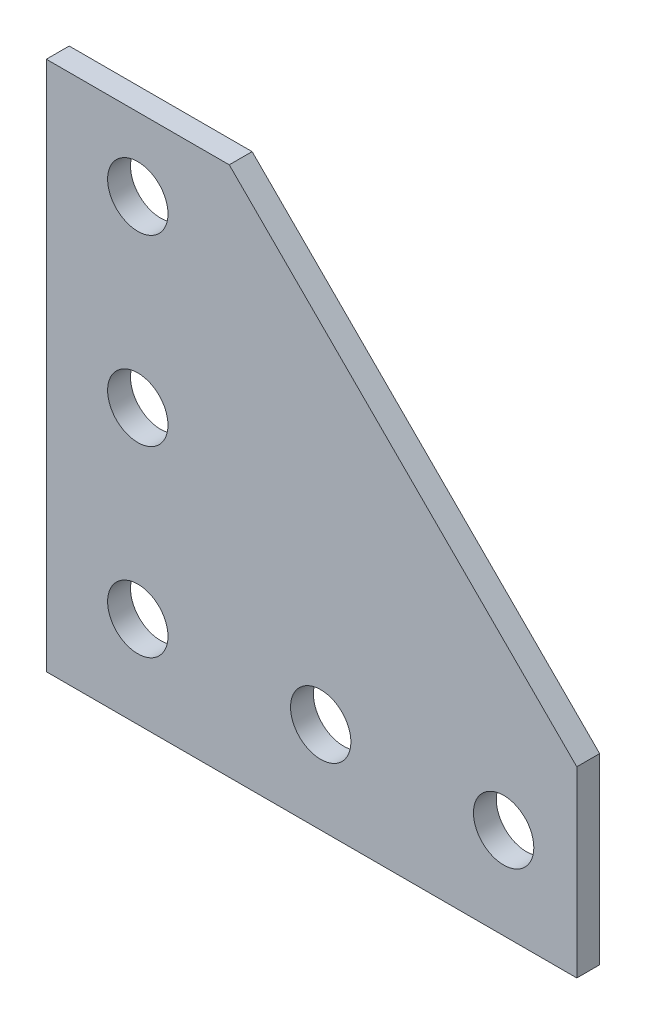
ISO-10303-21;
HEADER;
FILE_DESCRIPTION(('STEP AP214'),'2;1');
FILE_NAME('part.step','',(''),(''),'','','');
FILE_SCHEMA(('AUTOMOTIVE_DESIGN { 1 0 10303 214 1 1 1 1 }'));
ENDSEC;
DATA;
#1=APPLICATION_CONTEXT('core data for automotive mechanical design processes');
#2=APPLICATION_PROTOCOL_DEFINITION('international standard','automotive_design',2000,#1);
#3=PRODUCT_CONTEXT('',#1,'mechanical');
#4=PRODUCT('Part','Part','',(#3));
#5=PRODUCT_RELATED_PRODUCT_CATEGORY('part','',(#4));
#6=PRODUCT_DEFINITION_FORMATION('','',#4);
#7=PRODUCT_DEFINITION_CONTEXT('part definition',#1,'design');
#8=PRODUCT_DEFINITION('design','',#6,#7);
#9=PRODUCT_DEFINITION_SHAPE('','',#8);
#10=(LENGTH_UNIT() NAMED_UNIT(*) SI_UNIT(.MILLI.,.METRE.));
#11=(NAMED_UNIT(*) PLANE_ANGLE_UNIT() SI_UNIT($,.RADIAN.));
#12=(NAMED_UNIT(*) SI_UNIT($,.STERADIAN.) SOLID_ANGLE_UNIT());
#13=UNCERTAINTY_MEASURE_WITH_UNIT(LENGTH_MEASURE(1.E-05),#10,'distance_accuracy_value','');
#14=(GEOMETRIC_REPRESENTATION_CONTEXT(3) GLOBAL_UNCERTAINTY_ASSIGNED_CONTEXT((#13)) GLOBAL_UNIT_ASSIGNED_CONTEXT((#10,
#11,#12)) REPRESENTATION_CONTEXT('',''));
#15=CARTESIAN_POINT('',(0.,0.,0.));
#16=DIRECTION('',(0.,0.,1.));
#17=DIRECTION('',(1.,0.,0.));
#18=AXIS2_PLACEMENT_3D('',#15,#16,#17);
#19=CARTESIAN_POINT('',(-19.,21.,0.));
#20=DIRECTION('',(0.,0.,1.));
#21=DIRECTION('',(1.,0.,0.));
#22=AXIS2_PLACEMENT_3D('',#19,#20,#21);
#23=CYLINDRICAL_SURFACE('',#22,3.3);
#24=CARTESIAN_POINT('',(-19.,21.,0.));
#25=DIRECTION('',(0.,0.,1.));
#26=DIRECTION('',(1.,0.,0.));
#27=AXIS2_PLACEMENT_3D('',#24,#25,#26);
#28=CIRCLE('',#27,3.3);
#29=CARTESIAN_POINT('',(-15.7,21.,0.));
#30=VERTEX_POINT('',#29);
#31=EDGE_CURVE('E40',#30,#30,#28,.T.);
#32=ORIENTED_EDGE('',*,*,#31,.F.);
#33=EDGE_LOOP('',(#32));
#34=FACE_BOUND('',#33,.T.);
#35=CARTESIAN_POINT('',(-19.,21.,2.5));
#36=DIRECTION('',(0.,0.,1.));
#37=DIRECTION('',(1.,0.,0.));
#38=AXIS2_PLACEMENT_3D('',#35,#36,#37);
#39=CIRCLE('',#38,3.3);
#40=CARTESIAN_POINT('',(-15.7,21.,2.5));
#41=VERTEX_POINT('',#40);
#42=EDGE_CURVE('E11',#41,#41,#39,.T.);
#43=ORIENTED_EDGE('',*,*,#42,.T.);
#44=EDGE_LOOP('',(#43));
#45=FACE_BOUND('',#44,.T.);
#46=ADVANCED_FACE('F32',(#34,#45),#23,.F.);
#47=CARTESIAN_POINT('',(21.,-19.,0.));
#48=DIRECTION('',(0.,0.,1.));
#49=DIRECTION('',(1.,0.,0.));
#50=AXIS2_PLACEMENT_3D('',#47,#48,#49);
#51=CYLINDRICAL_SURFACE('',#50,3.3);
#52=CARTESIAN_POINT('',(21.,-19.,0.));
#53=DIRECTION('',(0.,0.,1.));
#54=DIRECTION('',(1.,0.,0.));
#55=AXIS2_PLACEMENT_3D('',#52,#53,#54);
#56=CIRCLE('',#55,3.3);
#57=CARTESIAN_POINT('',(24.3,-19.,0.));
#58=VERTEX_POINT('',#57);
#59=EDGE_CURVE('E124',#58,#58,#56,.T.);
#60=ORIENTED_EDGE('',*,*,#59,.F.);
#61=EDGE_LOOP('',(#60));
#62=FACE_BOUND('',#61,.T.);
#63=CARTESIAN_POINT('',(21.,-19.,2.5));
#64=DIRECTION('',(0.,0.,1.));
#65=DIRECTION('',(1.,0.,0.));
#66=AXIS2_PLACEMENT_3D('',#63,#64,#65);
#67=CIRCLE('',#66,3.3);
#68=CARTESIAN_POINT('',(24.3,-19.,2.5));
#69=VERTEX_POINT('',#68);
#70=EDGE_CURVE('E127',#69,#69,#67,.T.);
#71=ORIENTED_EDGE('',*,*,#70,.T.);
#72=EDGE_LOOP('',(#71));
#73=FACE_BOUND('',#72,.T.);
#74=ADVANCED_FACE('F136',(#62,#73),#51,.F.);
#75=CARTESIAN_POINT('',(29.,-8.99999999999999,2.5));
#76=DIRECTION('',(-1.,0.,0.));
#77=DIRECTION('',(0.,0.,1.));
#78=AXIS2_PLACEMENT_3D('',#75,#76,#77);
#79=PLANE('',#78);
#80=DIRECTION('',(0.,1.,0.));
#81=VECTOR('',#80,1.);
#82=CARTESIAN_POINT('',(29.,-8.99999999999999,0.));
#83=LINE('',#82,#81);
#84=CARTESIAN_POINT('',(29.,-29.,0.));
#85=VERTEX_POINT('',#84);
#86=CARTESIAN_POINT('',(29.,-8.99999999999999,0.));
#87=VERTEX_POINT('',#86);
#88=EDGE_CURVE('E109',#85,#87,#83,.T.);
#89=ORIENTED_EDGE('',*,*,#88,.T.);
#90=DIRECTION('',(0.,0.,-1.));
#91=VECTOR('',#90,1.);
#92=CARTESIAN_POINT('',(29.,-8.99999999999999,2.5));
#93=LINE('',#92,#91);
#94=CARTESIAN_POINT('',(29.,-8.99999999999999,2.5));
#95=VERTEX_POINT('',#94);
#96=EDGE_CURVE('E122',#95,#87,#93,.T.);
#97=ORIENTED_EDGE('',*,*,#96,.F.);
#98=DIRECTION('',(0.,1.,0.));
#99=VECTOR('',#98,1.);
#100=CARTESIAN_POINT('',(29.,-8.99999999999999,2.5));
#101=LINE('',#100,#99);
#102=CARTESIAN_POINT('',(29.,-29.,2.5));
#103=VERTEX_POINT('',#102);
#104=EDGE_CURVE('E118',#103,#95,#101,.T.);
#105=ORIENTED_EDGE('',*,*,#104,.F.);
#106=DIRECTION('',(0.,0.,-1.));
#107=VECTOR('',#106,1.);
#108=CARTESIAN_POINT('',(29.,-29.,2.5));
#109=LINE('',#108,#107);
#110=EDGE_CURVE('E105',#103,#85,#109,.T.);
#111=ORIENTED_EDGE('',*,*,#110,.T.);
#112=EDGE_LOOP('',(#89,#97,#105,#111));
#113=FACE_BOUND('',#112,.T.);
#114=ADVANCED_FACE('F163',(#113),#79,.F.);
#115=CARTESIAN_POINT('',(-9.00000000000001,29.,2.5));
#116=DIRECTION('',(-0.707106781186548,-0.707106781186548,0.));
#117=DIRECTION('',(0.707106781186548,-0.707106781186548,0.));
#118=AXIS2_PLACEMENT_3D('',#115,#116,#117);
#119=PLANE('',#118);
#120=DIRECTION('',(-0.707106781186547,0.707106781186547,0.));
#121=VECTOR('',#120,1.);
#122=CARTESIAN_POINT('',(-9.00000000000001,29.,0.));
#123=LINE('',#122,#121);
#124=CARTESIAN_POINT('',(-9.00000000000001,29.,0.));
#125=VERTEX_POINT('',#124);
#126=EDGE_CURVE('E112',#87,#125,#123,.T.);
#127=ORIENTED_EDGE('',*,*,#126,.T.);
#128=DIRECTION('',(0.,0.,-1.));
#129=VECTOR('',#128,1.);
#130=CARTESIAN_POINT('',(-9.00000000000001,29.,2.5));
#131=LINE('',#130,#129);
#132=CARTESIAN_POINT('',(-9.00000000000001,29.,2.5));
#133=VERTEX_POINT('',#132);
#134=EDGE_CURVE('E100',#133,#125,#131,.T.);
#135=ORIENTED_EDGE('',*,*,#134,.F.);
#136=DIRECTION('',(-0.707106781186547,0.707106781186547,0.));
#137=VECTOR('',#136,1.);
#138=CARTESIAN_POINT('',(-9.00000000000001,29.,2.5));
#139=LINE('',#138,#137);
#140=EDGE_CURVE('E83',#95,#133,#139,.T.);
#141=ORIENTED_EDGE('',*,*,#140,.F.);
#142=ORIENTED_EDGE('',*,*,#96,.T.);
#143=EDGE_LOOP('',(#127,#135,#141,#142));
#144=FACE_BOUND('',#143,.T.);
#145=ADVANCED_FACE('F160',(#144),#119,.F.);
#146=CARTESIAN_POINT('',(-29.,29.,2.5));
#147=DIRECTION('',(0.,-1.,0.));
#148=DIRECTION('',(0.,0.,-1.));
#149=AXIS2_PLACEMENT_3D('',#146,#147,#148);
#150=PLANE('',#149);
#151=DIRECTION('',(-1.,0.,0.));
#152=VECTOR('',#151,1.);
#153=CARTESIAN_POINT('',(-29.,29.,0.));
#154=LINE('',#153,#152);
#155=CARTESIAN_POINT('',(-29.,29.,0.));
#156=VERTEX_POINT('',#155);
#157=EDGE_CURVE('E99',#125,#156,#154,.T.);
#158=ORIENTED_EDGE('',*,*,#157,.T.);
#159=DIRECTION('',(0.,0.,-1.));
#160=VECTOR('',#159,1.);
#161=CARTESIAN_POINT('',(-29.,29.,2.5));
#162=LINE('',#161,#160);
#163=CARTESIAN_POINT('',(-29.,29.,2.5));
#164=VERTEX_POINT('',#163);
#165=EDGE_CURVE('E96',#164,#156,#162,.T.);
#166=ORIENTED_EDGE('',*,*,#165,.F.);
#167=DIRECTION('',(-1.,0.,0.));
#168=VECTOR('',#167,1.);
#169=CARTESIAN_POINT('',(-29.,29.,2.5));
#170=LINE('',#169,#168);
#171=EDGE_CURVE('E87',#133,#164,#170,.T.);
#172=ORIENTED_EDGE('',*,*,#171,.F.);
#173=ORIENTED_EDGE('',*,*,#134,.T.);
#174=EDGE_LOOP('',(#158,#166,#172,#173));
#175=FACE_BOUND('',#174,.T.);
#176=ADVANCED_FACE('F97',(#175),#150,.F.);
#177=CARTESIAN_POINT('',(-29.,29.,2.5));
#178=DIRECTION('',(1.,0.,0.));
#179=DIRECTION('',(0.,1.,0.));
#180=AXIS2_PLACEMENT_3D('',#177,#178,#179);
#181=PLANE('',#180);
#182=DIRECTION('',(0.,-1.,0.));
#183=VECTOR('',#182,1.);
#184=CARTESIAN_POINT('',(-29.,29.,0.));
#185=LINE('',#184,#183);
#186=CARTESIAN_POINT('',(-29.,-29.,0.));
#187=VERTEX_POINT('',#186);
#188=EDGE_CURVE('E68',#156,#187,#185,.T.);
#189=ORIENTED_EDGE('',*,*,#188,.T.);
#190=DIRECTION('',(0.,0.,-1.));
#191=VECTOR('',#190,1.);
#192=CARTESIAN_POINT('',(-29.,-29.,2.5));
#193=LINE('',#192,#191);
#194=CARTESIAN_POINT('',(-29.,-29.,2.5));
#195=VERTEX_POINT('',#194);
#196=EDGE_CURVE('E101',#195,#187,#193,.T.);
#197=ORIENTED_EDGE('',*,*,#196,.F.);
#198=DIRECTION('',(0.,-1.,0.));
#199=VECTOR('',#198,1.);
#200=CARTESIAN_POINT('',(-29.,29.,2.5));
#201=LINE('',#200,#199);
#202=EDGE_CURVE('E92',#164,#195,#201,.T.);
#203=ORIENTED_EDGE('',*,*,#202,.F.);
#204=ORIENTED_EDGE('',*,*,#165,.T.);
#205=EDGE_LOOP('',(#189,#197,#203,#204));
#206=FACE_BOUND('',#205,.T.);
#207=ADVANCED_FACE('F103',(#206),#181,.F.);
#208=CARTESIAN_POINT('',(-29.,-29.,2.5));
#209=DIRECTION('',(0.,1.,0.));
#210=DIRECTION('',(0.,0.,1.));
#211=AXIS2_PLACEMENT_3D('',#208,#209,#210);
#212=PLANE('',#211);
#213=DIRECTION('',(1.,0.,0.));
#214=VECTOR('',#213,1.);
#215=CARTESIAN_POINT('',(-29.,-29.,0.));
#216=LINE('',#215,#214);
#217=EDGE_CURVE('E74',#187,#85,#216,.T.);
#218=ORIENTED_EDGE('',*,*,#217,.T.);
#219=ORIENTED_EDGE('',*,*,#110,.F.);
#220=DIRECTION('',(1.,0.,0.));
#221=VECTOR('',#220,1.);
#222=CARTESIAN_POINT('',(-29.,-29.,2.5));
#223=LINE('',#222,#221);
#224=EDGE_CURVE('E48',#195,#103,#223,.T.);
#225=ORIENTED_EDGE('',*,*,#224,.F.);
#226=ORIENTED_EDGE('',*,*,#196,.T.);
#227=EDGE_LOOP('',(#218,#219,#225,#226));
#228=FACE_BOUND('',#227,.T.);
#229=ADVANCED_FACE('F140',(#228),#212,.F.);
#230=CARTESIAN_POINT('',(0.,0.,2.5));
#231=DIRECTION('',(0.,0.,1.));
#232=DIRECTION('',(1.,0.,0.));
#233=AXIS2_PLACEMENT_3D('',#230,#231,#232);
#234=PLANE('',#233);
#235=CARTESIAN_POINT('',(-19.,1.00000000000001,2.5));
#236=DIRECTION('',(0.,0.,1.));
#237=DIRECTION('',(1.,0.,0.));
#238=AXIS2_PLACEMENT_3D('',#235,#236,#237);
#239=CIRCLE('',#238,3.3);
#240=CARTESIAN_POINT('',(-15.7,1.00000000000001,2.5));
#241=VERTEX_POINT('',#240);
#242=EDGE_CURVE('E248',#241,#241,#239,.T.);
#243=ORIENTED_EDGE('',*,*,#242,.F.);
#244=EDGE_LOOP('',(#243));
#245=FACE_BOUND('',#244,.T.);
#246=CARTESIAN_POINT('',(0.99999999999999,-19.,2.5));
#247=DIRECTION('',(0.,0.,1.));
#248=DIRECTION('',(1.,0.,0.));
#249=AXIS2_PLACEMENT_3D('',#246,#247,#248);
#250=CIRCLE('',#249,3.3);
#251=CARTESIAN_POINT('',(4.29999999999999,-19.,2.5));
#252=VERTEX_POINT('',#251);
#253=EDGE_CURVE('E252',#252,#252,#250,.T.);
#254=ORIENTED_EDGE('',*,*,#253,.F.);
#255=EDGE_LOOP('',(#254));
#256=FACE_BOUND('',#255,.T.);
#257=CARTESIAN_POINT('',(-19.,-19.,2.5));
#258=DIRECTION('',(0.,0.,1.));
#259=DIRECTION('',(1.,0.,0.));
#260=AXIS2_PLACEMENT_3D('',#257,#258,#259);
#261=CIRCLE('',#260,3.3);
#262=CARTESIAN_POINT('',(-15.7,-19.,2.5));
#263=VERTEX_POINT('',#262);
#264=EDGE_CURVE('E258',#263,#263,#261,.T.);
#265=ORIENTED_EDGE('',*,*,#264,.F.);
#266=EDGE_LOOP('',(#265));
#267=FACE_BOUND('',#266,.T.);
#268=ORIENTED_EDGE('',*,*,#104,.T.);
#269=ORIENTED_EDGE('',*,*,#140,.T.);
#270=ORIENTED_EDGE('',*,*,#171,.T.);
#271=ORIENTED_EDGE('',*,*,#202,.T.);
#272=ORIENTED_EDGE('',*,*,#224,.T.);
#273=EDGE_LOOP('',(#268,#269,#270,#271,#272));
#274=FACE_BOUND('',#273,.T.);
#275=ORIENTED_EDGE('',*,*,#70,.F.);
#276=EDGE_LOOP('',(#275));
#277=FACE_BOUND('',#276,.T.);
#278=ORIENTED_EDGE('',*,*,#42,.F.);
#279=EDGE_LOOP('',(#278));
#280=FACE_BOUND('',#279,.T.);
#281=ADVANCED_FACE('F89',(#245,#256,#267,#274,#277,#280),#234,.T.);
#282=CARTESIAN_POINT('',(0.,0.,0.));
#283=DIRECTION('',(0.,0.,1.));
#284=DIRECTION('',(1.,0.,0.));
#285=AXIS2_PLACEMENT_3D('',#282,#283,#284);
#286=PLANE('',#285);
#287=CARTESIAN_POINT('',(-19.,1.00000000000001,0.));
#288=DIRECTION('',(0.,0.,1.));
#289=DIRECTION('',(1.,0.,0.));
#290=AXIS2_PLACEMENT_3D('',#287,#288,#289);
#291=CIRCLE('',#290,3.3);
#292=CARTESIAN_POINT('',(-15.7,1.00000000000001,0.));
#293=VERTEX_POINT('',#292);
#294=EDGE_CURVE('E246',#293,#293,#291,.T.);
#295=ORIENTED_EDGE('',*,*,#294,.T.);
#296=EDGE_LOOP('',(#295));
#297=FACE_BOUND('',#296,.T.);
#298=CARTESIAN_POINT('',(0.99999999999999,-19.,0.));
#299=DIRECTION('',(0.,0.,1.));
#300=DIRECTION('',(1.,0.,0.));
#301=AXIS2_PLACEMENT_3D('',#298,#299,#300);
#302=CIRCLE('',#301,3.3);
#303=CARTESIAN_POINT('',(4.29999999999999,-19.,0.));
#304=VERTEX_POINT('',#303);
#305=EDGE_CURVE('E249',#304,#304,#302,.T.);
#306=ORIENTED_EDGE('',*,*,#305,.T.);
#307=EDGE_LOOP('',(#306));
#308=FACE_BOUND('',#307,.T.);
#309=CARTESIAN_POINT('',(-19.,-19.,0.));
#310=DIRECTION('',(0.,0.,1.));
#311=DIRECTION('',(1.,0.,0.));
#312=AXIS2_PLACEMENT_3D('',#309,#310,#311);
#313=CIRCLE('',#312,3.3);
#314=CARTESIAN_POINT('',(-15.7,-19.,0.));
#315=VERTEX_POINT('',#314);
#316=EDGE_CURVE('E113',#315,#315,#313,.T.);
#317=ORIENTED_EDGE('',*,*,#316,.T.);
#318=EDGE_LOOP('',(#317));
#319=FACE_BOUND('',#318,.T.);
#320=ORIENTED_EDGE('',*,*,#88,.F.);
#321=ORIENTED_EDGE('',*,*,#217,.F.);
#322=ORIENTED_EDGE('',*,*,#188,.F.);
#323=ORIENTED_EDGE('',*,*,#157,.F.);
#324=ORIENTED_EDGE('',*,*,#126,.F.);
#325=EDGE_LOOP('',(#320,#321,#322,#323,#324));
#326=FACE_BOUND('',#325,.T.);
#327=ORIENTED_EDGE('',*,*,#59,.T.);
#328=EDGE_LOOP('',(#327));
#329=FACE_BOUND('',#328,.T.);
#330=ORIENTED_EDGE('',*,*,#31,.T.);
#331=EDGE_LOOP('',(#330));
#332=FACE_BOUND('',#331,.T.);
#333=ADVANCED_FACE('F132',(#297,#308,#319,#326,#329,#332),#286,.F.);
#334=CARTESIAN_POINT('',(-19.,-19.,0.));
#335=DIRECTION('',(0.,0.,1.));
#336=DIRECTION('',(1.,0.,0.));
#337=AXIS2_PLACEMENT_3D('',#334,#335,#336);
#338=CYLINDRICAL_SURFACE('',#337,3.3);
#339=ORIENTED_EDGE('',*,*,#316,.F.);
#340=EDGE_LOOP('',(#339));
#341=FACE_BOUND('',#340,.T.);
#342=ORIENTED_EDGE('',*,*,#264,.T.);
#343=EDGE_LOOP('',(#342));
#344=FACE_BOUND('',#343,.T.);
#345=ADVANCED_FACE('F147',(#341,#344),#338,.F.);
#346=CARTESIAN_POINT('',(0.99999999999999,-19.,0.));
#347=DIRECTION('',(0.,0.,1.));
#348=DIRECTION('',(1.,0.,0.));
#349=AXIS2_PLACEMENT_3D('',#346,#347,#348);
#350=CYLINDRICAL_SURFACE('',#349,3.3);
#351=ORIENTED_EDGE('',*,*,#305,.F.);
#352=EDGE_LOOP('',(#351));
#353=FACE_BOUND('',#352,.T.);
#354=ORIENTED_EDGE('',*,*,#253,.T.);
#355=EDGE_LOOP('',(#354));
#356=FACE_BOUND('',#355,.T.);
#357=ADVANCED_FACE('F206',(#353,#356),#350,.F.);
#358=CARTESIAN_POINT('',(-19.,1.00000000000001,0.));
#359=DIRECTION('',(0.,0.,1.));
#360=DIRECTION('',(1.,0.,0.));
#361=AXIS2_PLACEMENT_3D('',#358,#359,#360);
#362=CYLINDRICAL_SURFACE('',#361,3.3);
#363=ORIENTED_EDGE('',*,*,#294,.F.);
#364=EDGE_LOOP('',(#363));
#365=FACE_BOUND('',#364,.T.);
#366=ORIENTED_EDGE('',*,*,#242,.T.);
#367=EDGE_LOOP('',(#366));
#368=FACE_BOUND('',#367,.T.);
#369=ADVANCED_FACE('F217',(#365,#368),#362,.F.);
#370=CLOSED_SHELL('',(#46,#74,#114,#145,#176,#207,#229,#281,#333,#345,#357,#369));
#371=MANIFOLD_SOLID_BREP('B2',#370);
#372=ADVANCED_BREP_SHAPE_REPRESENTATION('',(#18,#371),#14);
#373=SHAPE_DEFINITION_REPRESENTATION(#9,#372);
ENDSEC;
END-ISO-10303-21;
